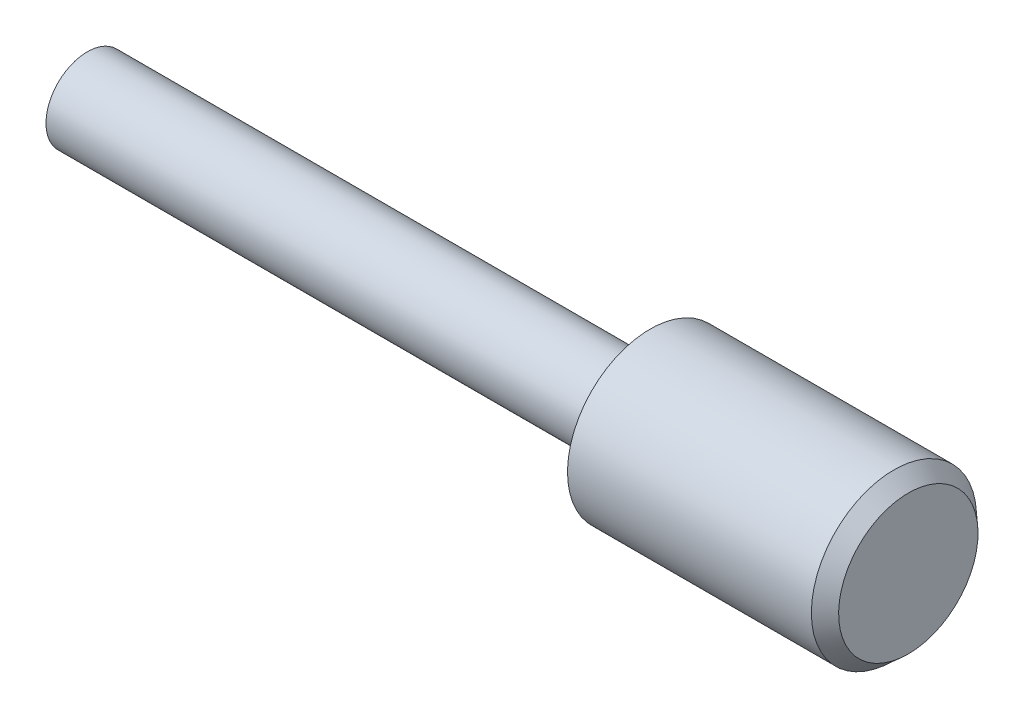
ISO-10303-21;
HEADER;
FILE_DESCRIPTION(('STEP AP214'),'2;1');
FILE_NAME('part.step','',(''),(''),'','','');
FILE_SCHEMA(('AUTOMOTIVE_DESIGN { 1 0 10303 214 1 1 1 1 }'));
ENDSEC;
DATA;
#1=APPLICATION_CONTEXT('core data for automotive mechanical design processes');
#2=APPLICATION_PROTOCOL_DEFINITION('international standard','automotive_design',2000,#1);
#3=PRODUCT_CONTEXT('',#1,'mechanical');
#4=PRODUCT('Part','Part','',(#3));
#5=PRODUCT_RELATED_PRODUCT_CATEGORY('part','',(#4));
#6=PRODUCT_DEFINITION_FORMATION('','',#4);
#7=PRODUCT_DEFINITION_CONTEXT('part definition',#1,'design');
#8=PRODUCT_DEFINITION('design','',#6,#7);
#9=PRODUCT_DEFINITION_SHAPE('','',#8);
#10=(LENGTH_UNIT() NAMED_UNIT(*) SI_UNIT(.MILLI.,.METRE.));
#11=(NAMED_UNIT(*) PLANE_ANGLE_UNIT() SI_UNIT($,.RADIAN.));
#12=(NAMED_UNIT(*) SI_UNIT($,.STERADIAN.) SOLID_ANGLE_UNIT());
#13=UNCERTAINTY_MEASURE_WITH_UNIT(LENGTH_MEASURE(1.E-05),#10,'distance_accuracy_value','');
#14=(GEOMETRIC_REPRESENTATION_CONTEXT(3) GLOBAL_UNCERTAINTY_ASSIGNED_CONTEXT((#13)) GLOBAL_UNIT_ASSIGNED_CONTEXT((#10,
#11,#12)) REPRESENTATION_CONTEXT('',''));
#15=CARTESIAN_POINT('',(0.,0.,0.));
#16=DIRECTION('',(0.,0.,1.));
#17=DIRECTION('',(1.,0.,0.));
#18=AXIS2_PLACEMENT_3D('',#15,#16,#17);
#19=CARTESIAN_POINT('',(0.,0.,0.));
#20=DIRECTION('',(1.,0.,0.));
#21=DIRECTION('',(0.,1.,0.));
#22=AXIS2_PLACEMENT_3D('',#19,#20,#21);
#23=PLANE('',#22);
#24=CARTESIAN_POINT('',(0.,-32.,0.));
#25=DIRECTION('',(-1.,0.,0.));
#26=DIRECTION('',(0.,-1.,0.));
#27=AXIS2_PLACEMENT_3D('',#24,#25,#26);
#28=CIRCLE('',#27,16.);
#29=CARTESIAN_POINT('',(0.,-48.,0.));
#30=VERTEX_POINT('',#29);
#31=EDGE_CURVE('E42',#30,#30,#28,.T.);
#32=ORIENTED_EDGE('',*,*,#31,.F.);
#33=EDGE_LOOP('',(#32));
#34=FACE_BOUND('',#33,.T.);
#35=CARTESIAN_POINT('',(0.,-32.,0.));
#36=DIRECTION('',(-1.,0.,0.));
#37=DIRECTION('',(0.,-1.,0.));
#38=AXIS2_PLACEMENT_3D('',#35,#36,#37);
#39=CIRCLE('',#38,32.);
#40=CARTESIAN_POINT('',(0.,-64.,0.));
#41=VERTEX_POINT('',#40);
#42=EDGE_CURVE('E51',#41,#41,#39,.T.);
#43=ORIENTED_EDGE('',*,*,#42,.T.);
#44=EDGE_LOOP('',(#43));
#45=FACE_BOUND('',#44,.T.);
#46=ADVANCED_FACE('F31',(#34,#45),#23,.F.);
#47=CARTESIAN_POINT('',(-218.,-32.,0.));
#48=DIRECTION('',(-1.,0.,0.));
#49=DIRECTION('',(0.,-1.,0.));
#50=AXIS2_PLACEMENT_3D('',#47,#48,#49);
#51=CYLINDRICAL_SURFACE('',#50,16.);
#52=CARTESIAN_POINT('',(-218.,-32.,0.));
#53=DIRECTION('',(-1.,0.,0.));
#54=DIRECTION('',(0.,-1.,0.));
#55=AXIS2_PLACEMENT_3D('',#52,#53,#54);
#56=CIRCLE('',#55,16.);
#57=CARTESIAN_POINT('',(-218.,-48.,0.));
#58=VERTEX_POINT('',#57);
#59=EDGE_CURVE('E46',#58,#58,#56,.T.);
#60=ORIENTED_EDGE('',*,*,#59,.F.);
#61=EDGE_LOOP('',(#60));
#62=FACE_BOUND('',#61,.T.);
#63=ORIENTED_EDGE('',*,*,#31,.T.);
#64=EDGE_LOOP('',(#63));
#65=FACE_BOUND('',#64,.T.);
#66=ADVANCED_FACE('F68',(#62,#65),#51,.T.);
#67=CARTESIAN_POINT('',(-218.,-32.,0.));
#68=DIRECTION('',(1.,0.,0.));
#69=DIRECTION('',(0.,1.,0.));
#70=AXIS2_PLACEMENT_3D('',#67,#68,#69);
#71=PLANE('',#70);
#72=ORIENTED_EDGE('',*,*,#59,.T.);
#73=EDGE_LOOP('',(#72));
#74=FACE_BOUND('',#73,.T.);
#75=ADVANCED_FACE('F65',(#74),#71,.F.);
#76=CARTESIAN_POINT('',(100.,0.,0.));
#77=DIRECTION('',(-1.,0.,0.));
#78=DIRECTION('',(0.,-1.,0.));
#79=AXIS2_PLACEMENT_3D('',#76,#77,#78);
#80=PLANE('',#79);
#81=CARTESIAN_POINT('',(100.,-32.,0.));
#82=DIRECTION('',(-1.,0.,0.));
#83=DIRECTION('',(0.,-1.,0.));
#84=AXIS2_PLACEMENT_3D('',#81,#82,#83);
#85=CIRCLE('',#84,27.);
#86=CARTESIAN_POINT('',(100.,-59.,0.));
#87=VERTEX_POINT('',#86);
#88=EDGE_CURVE('E10',#87,#87,#85,.F.);
#89=ORIENTED_EDGE('',*,*,#88,.T.);
#90=EDGE_LOOP('',(#89));
#91=FACE_BOUND('',#90,.T.);
#92=ADVANCED_FACE('F58',(#91),#80,.F.);
#93=CARTESIAN_POINT('',(-218.,-32.,0.));
#94=DIRECTION('',(-1.,0.,0.));
#95=DIRECTION('',(0.,-1.,0.));
#96=AXIS2_PLACEMENT_3D('',#93,#94,#95);
#97=CYLINDRICAL_SURFACE('',#96,32.);
#98=CARTESIAN_POINT('',(94.446937425854,-32.,0.));
#99=DIRECTION('',(-1.,0.,0.));
#100=DIRECTION('',(0.,0.,1.));
#101=AXIS2_PLACEMENT_3D('',#98,#99,#100);
#102=CIRCLE('',#101,32.);
#103=CARTESIAN_POINT('',(94.446937425854,-32.,32.));
#104=VERTEX_POINT('',#103);
#105=EDGE_CURVE('E38',#104,#104,#102,.T.);
#106=ORIENTED_EDGE('',*,*,#105,.T.);
#107=EDGE_LOOP('',(#106));
#108=FACE_BOUND('',#107,.T.);
#109=ORIENTED_EDGE('',*,*,#42,.F.);
#110=EDGE_LOOP('',(#109));
#111=FACE_BOUND('',#110,.T.);
#112=ADVANCED_FACE('F56',(#108,#111),#97,.T.);
#113=CARTESIAN_POINT('',(94.446937425854,-32.,0.));
#114=DIRECTION('',(-1.,0.,0.));
#115=DIRECTION('',(0.,0.,1.));
#116=AXIS2_PLACEMENT_3D('',#113,#114,#115);
#117=CONICAL_SURFACE('',#116,32.,0.733038285837618);
#118=ORIENTED_EDGE('',*,*,#88,.F.);
#119=EDGE_LOOP('',(#118));
#120=FACE_BOUND('',#119,.T.);
#121=ORIENTED_EDGE('',*,*,#105,.F.);
#122=EDGE_LOOP('',(#121));
#123=FACE_BOUND('',#122,.T.);
#124=ADVANCED_FACE('F33',(#120,#123),#117,.T.);
#125=CLOSED_SHELL('',(#46,#66,#75,#92,#112,#124));
#126=MANIFOLD_SOLID_BREP('B2',#125);
#127=ADVANCED_BREP_SHAPE_REPRESENTATION('',(#18,#126),#14);
#128=SHAPE_DEFINITION_REPRESENTATION(#9,#127);
ENDSEC;
END-ISO-10303-21;
